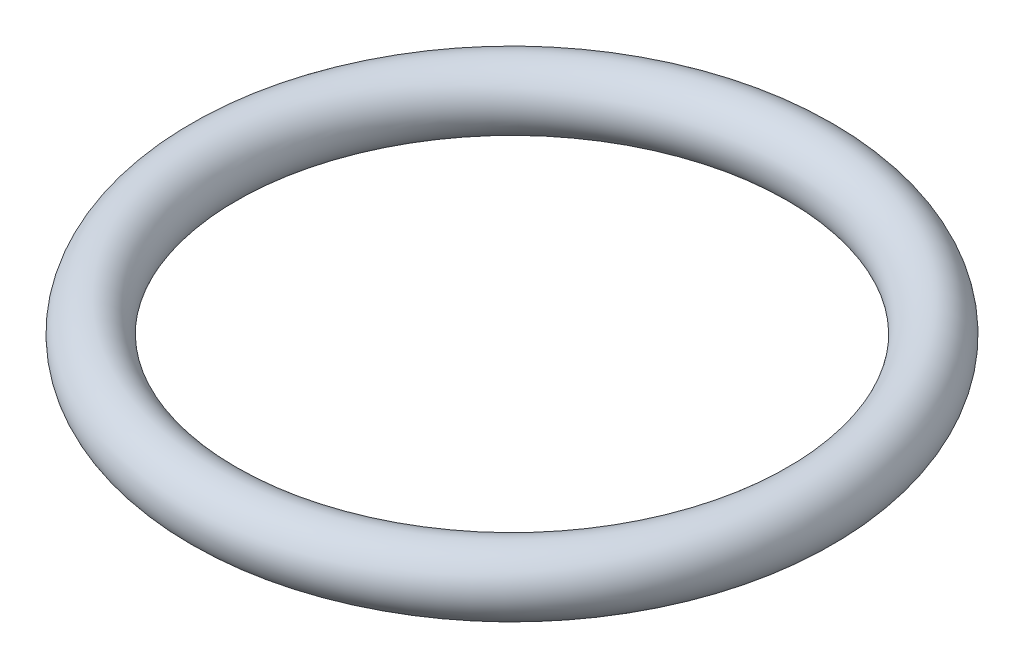
ISO-10303-21;
HEADER;
FILE_DESCRIPTION(('STEP AP214'),'2;1');
FILE_NAME('part.step','',(''),(''),'','','');
FILE_SCHEMA(('AUTOMOTIVE_DESIGN { 1 0 10303 214 1 1 1 1 }'));
ENDSEC;
DATA;
#1=APPLICATION_CONTEXT('core data for automotive mechanical design processes');
#2=APPLICATION_PROTOCOL_DEFINITION('international standard','automotive_design',2000,#1);
#3=PRODUCT_CONTEXT('',#1,'mechanical');
#4=PRODUCT('Part','Part','',(#3));
#5=PRODUCT_RELATED_PRODUCT_CATEGORY('part','',(#4));
#6=PRODUCT_DEFINITION_FORMATION('','',#4);
#7=PRODUCT_DEFINITION_CONTEXT('part definition',#1,'design');
#8=PRODUCT_DEFINITION('design','',#6,#7);
#9=PRODUCT_DEFINITION_SHAPE('','',#8);
#10=(LENGTH_UNIT() NAMED_UNIT(*) SI_UNIT(.MILLI.,.METRE.));
#11=(NAMED_UNIT(*) PLANE_ANGLE_UNIT() SI_UNIT($,.RADIAN.));
#12=(NAMED_UNIT(*) SI_UNIT($,.STERADIAN.) SOLID_ANGLE_UNIT());
#13=UNCERTAINTY_MEASURE_WITH_UNIT(LENGTH_MEASURE(1.E-05),#10,'distance_accuracy_value','');
#14=(GEOMETRIC_REPRESENTATION_CONTEXT(3) GLOBAL_UNCERTAINTY_ASSIGNED_CONTEXT((#13)) GLOBAL_UNIT_ASSIGNED_CONTEXT((#10,
#11,#12)) REPRESENTATION_CONTEXT('',''));
#15=CARTESIAN_POINT('',(0.,0.,0.));
#16=DIRECTION('',(0.,0.,1.));
#17=DIRECTION('',(1.,0.,0.));
#18=AXIS2_PLACEMENT_3D('',#15,#16,#17);
#19=CARTESIAN_POINT('',(0.,0.,0.));
#20=DIRECTION('',(0.,1.,0.));
#21=DIRECTION('',(0.,0.,1.));
#22=AXIS2_PLACEMENT_3D('',#19,#20,#21);
#23=TOROIDAL_SURFACE('',#22,6.6,0.700000000000001);
#24=CARTESIAN_POINT('',(0.,0.,7.3));
#25=VERTEX_POINT('',#24);
#26=VERTEX_LOOP('',#25);
#27=FACE_BOUND('',#26,.T.);
#28=ADVANCED_FACE('F30',(#27),#23,.T.);
#29=CLOSED_SHELL('',(#28));
#30=MANIFOLD_SOLID_BREP('B2',#29);
#31=ADVANCED_BREP_SHAPE_REPRESENTATION('',(#18,#30),#14);
#32=SHAPE_DEFINITION_REPRESENTATION(#9,#31);
ENDSEC;
END-ISO-10303-21;
